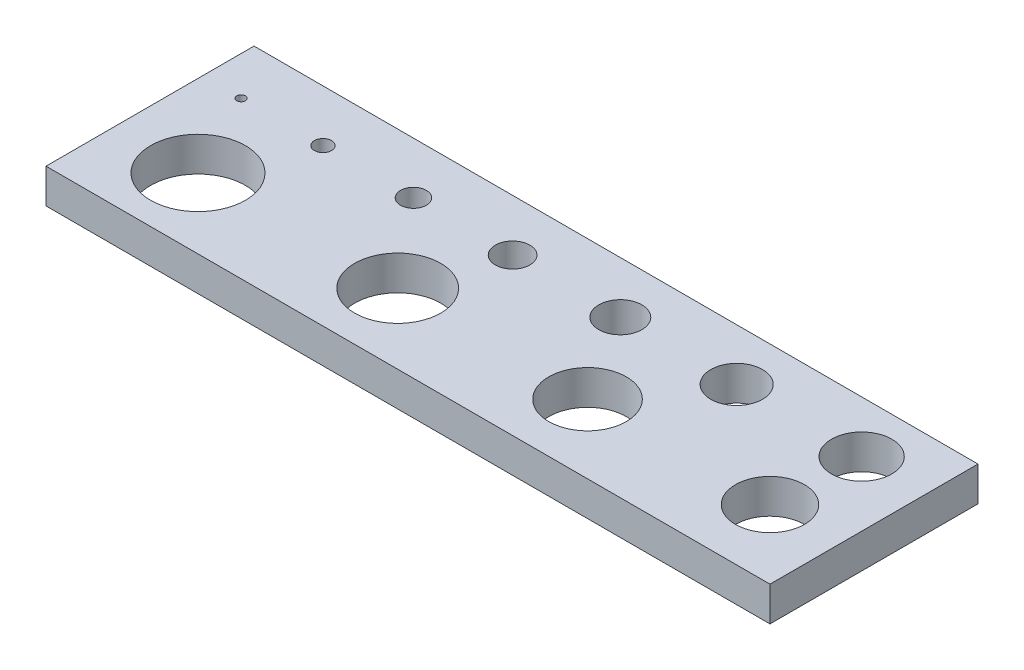
ISO-10303-21;
HEADER;
FILE_DESCRIPTION(('STEP AP214'),'2;1');
FILE_NAME('part.step','',(''),(''),'','','');
FILE_SCHEMA(('AUTOMOTIVE_DESIGN { 1 0 10303 214 1 1 1 1 }'));
ENDSEC;
DATA;
#1=APPLICATION_CONTEXT('core data for automotive mechanical design processes');
#2=APPLICATION_PROTOCOL_DEFINITION('international standard','automotive_design',2000,#1);
#3=PRODUCT_CONTEXT('',#1,'mechanical');
#4=PRODUCT('Part','Part','',(#3));
#5=PRODUCT_RELATED_PRODUCT_CATEGORY('part','',(#4));
#6=PRODUCT_DEFINITION_FORMATION('','',#4);
#7=PRODUCT_DEFINITION_CONTEXT('part definition',#1,'design');
#8=PRODUCT_DEFINITION('design','',#6,#7);
#9=PRODUCT_DEFINITION_SHAPE('','',#8);
#10=(LENGTH_UNIT() NAMED_UNIT(*) SI_UNIT(.MILLI.,.METRE.));
#11=(NAMED_UNIT(*) PLANE_ANGLE_UNIT() SI_UNIT($,.RADIAN.));
#12=(NAMED_UNIT(*) SI_UNIT($,.STERADIAN.) SOLID_ANGLE_UNIT());
#13=UNCERTAINTY_MEASURE_WITH_UNIT(LENGTH_MEASURE(1.E-05),#10,'distance_accuracy_value','');
#14=(GEOMETRIC_REPRESENTATION_CONTEXT(3) GLOBAL_UNCERTAINTY_ASSIGNED_CONTEXT((#13)) GLOBAL_UNIT_ASSIGNED_CONTEXT((#10,
#11,#12)) REPRESENTATION_CONTEXT('',''));
#15=CARTESIAN_POINT('',(0.,0.,0.));
#16=DIRECTION('',(0.,0.,1.));
#17=DIRECTION('',(1.,0.,0.));
#18=AXIS2_PLACEMENT_3D('',#15,#16,#17);
#19=CARTESIAN_POINT('',(0.,10.,0.));
#20=DIRECTION('',(0.,-1.,0.));
#21=DIRECTION('',(0.,0.,-1.));
#22=AXIS2_PLACEMENT_3D('',#19,#20,#21);
#23=PLANE('',#22);
#24=DIRECTION('',(0.,0.,1.));
#25=VECTOR('',#24,1.);
#26=CARTESIAN_POINT('',(-11.25,10.,45.3421622003745));
#27=LINE('',#26,#25);
#28=CARTESIAN_POINT('',(-11.25,10.,-15.));
#29=VERTEX_POINT('',#28);
#30=CARTESIAN_POINT('',(-11.25,10.,45.3421622003745));
#31=VERTEX_POINT('',#30);
#32=EDGE_CURVE('E85',#29,#31,#27,.T.);
#33=ORIENTED_EDGE('',*,*,#32,.T.);
#34=DIRECTION('',(1.,0.,0.));
#35=VECTOR('',#34,1.);
#36=CARTESIAN_POINT('',(-11.25,10.,45.3421622003745));
#37=LINE('',#36,#35);
#38=CARTESIAN_POINT('',(198.75,10.,45.3421622003745));
#39=VERTEX_POINT('',#38);
#40=EDGE_CURVE('E80',#31,#39,#37,.T.);
#41=ORIENTED_EDGE('',*,*,#40,.T.);
#42=DIRECTION('',(0.,0.,-1.));
#43=VECTOR('',#42,1.);
#44=CARTESIAN_POINT('',(198.75,10.,45.3421622003745));
#45=LINE('',#44,#43);
#46=CARTESIAN_POINT('',(198.75,10.,-15.));
#47=VERTEX_POINT('',#46);
#48=EDGE_CURVE('E83',#39,#47,#45,.T.);
#49=ORIENTED_EDGE('',*,*,#48,.T.);
#50=DIRECTION('',(-1.,0.,0.));
#51=VECTOR('',#50,1.);
#52=CARTESIAN_POINT('',(-11.25,10.,-15.));
#53=LINE('',#52,#51);
#54=EDGE_CURVE('E50',#47,#29,#53,.T.);
#55=ORIENTED_EDGE('',*,*,#54,.T.);
#56=EDGE_LOOP('',(#33,#41,#49,#55));
#57=FACE_BOUND('',#56,.T.);
#58=CARTESIAN_POINT('',(0.,10.,0.));
#59=DIRECTION('',(0.,1.,0.));
#60=DIRECTION('',(0.,0.,1.));
#61=AXIS2_PLACEMENT_3D('',#58,#59,#60);
#62=CIRCLE('',#61,1.25);
#63=CARTESIAN_POINT('',(0.,10.,1.25));
#64=VERTEX_POINT('',#63);
#65=EDGE_CURVE('E100',#64,#64,#62,.T.);
#66=ORIENTED_EDGE('',*,*,#65,.F.);
#67=EDGE_LOOP('',(#66));
#68=FACE_BOUND('',#67,.T.);
#69=CARTESIAN_POINT('',(23.75,10.,0.));
#70=DIRECTION('',(0.,1.,0.));
#71=DIRECTION('',(0.,0.,1.));
#72=AXIS2_PLACEMENT_3D('',#69,#70,#71);
#73=CIRCLE('',#72,2.49999999999999);
#74=CARTESIAN_POINT('',(23.75,10.,2.49999999999999));
#75=VERTEX_POINT('',#74);
#76=EDGE_CURVE('E115',#75,#75,#73,.T.);
#77=ORIENTED_EDGE('',*,*,#76,.F.);
#78=EDGE_LOOP('',(#77));
#79=FACE_BOUND('',#78,.T.);
#80=CARTESIAN_POINT('',(50.,10.,0.));
#81=DIRECTION('',(0.,1.,0.));
#82=DIRECTION('',(0.,0.,1.));
#83=AXIS2_PLACEMENT_3D('',#80,#81,#82);
#84=CIRCLE('',#83,3.75000000000001);
#85=CARTESIAN_POINT('',(50.,10.,3.75000000000001));
#86=VERTEX_POINT('',#85);
#87=EDGE_CURVE('E121',#86,#86,#84,.T.);
#88=ORIENTED_EDGE('',*,*,#87,.F.);
#89=EDGE_LOOP('',(#88));
#90=FACE_BOUND('',#89,.T.);
#91=CARTESIAN_POINT('',(78.75,10.,0.));
#92=DIRECTION('',(0.,1.,0.));
#93=DIRECTION('',(0.,0.,1.));
#94=AXIS2_PLACEMENT_3D('',#91,#92,#93);
#95=CIRCLE('',#94,4.99999999999999);
#96=CARTESIAN_POINT('',(78.75,10.,4.99999999999999));
#97=VERTEX_POINT('',#96);
#98=EDGE_CURVE('E127',#97,#97,#95,.T.);
#99=ORIENTED_EDGE('',*,*,#98,.F.);
#100=EDGE_LOOP('',(#99));
#101=FACE_BOUND('',#100,.T.);
#102=CARTESIAN_POINT('',(110.,10.,0.));
#103=DIRECTION('',(0.,1.,0.));
#104=DIRECTION('',(0.,0.,1.));
#105=AXIS2_PLACEMENT_3D('',#102,#103,#104);
#106=CIRCLE('',#105,6.25);
#107=CARTESIAN_POINT('',(110.,10.,6.25));
#108=VERTEX_POINT('',#107);
#109=EDGE_CURVE('E133',#108,#108,#106,.T.);
#110=ORIENTED_EDGE('',*,*,#109,.F.);
#111=EDGE_LOOP('',(#110));
#112=FACE_BOUND('',#111,.T.);
#113=CARTESIAN_POINT('',(143.75,10.,0.));
#114=DIRECTION('',(0.,1.,0.));
#115=DIRECTION('',(0.,0.,1.));
#116=AXIS2_PLACEMENT_3D('',#113,#114,#115);
#117=CIRCLE('',#116,7.50000000000001);
#118=CARTESIAN_POINT('',(143.75,10.,7.50000000000001));
#119=VERTEX_POINT('',#118);
#120=EDGE_CURVE('E139',#119,#119,#117,.T.);
#121=ORIENTED_EDGE('',*,*,#120,.F.);
#122=EDGE_LOOP('',(#121));
#123=FACE_BOUND('',#122,.T.);
#124=CARTESIAN_POINT('',(180.,10.,0.));
#125=DIRECTION('',(0.,1.,0.));
#126=DIRECTION('',(0.,0.,1.));
#127=AXIS2_PLACEMENT_3D('',#124,#125,#126);
#128=CIRCLE('',#127,8.74999999999997);
#129=CARTESIAN_POINT('',(180.,10.,8.74999999999997));
#130=VERTEX_POINT('',#129);
#131=EDGE_CURVE('E145',#130,#130,#128,.T.);
#132=ORIENTED_EDGE('',*,*,#131,.F.);
#133=EDGE_LOOP('',(#132));
#134=FACE_BOUND('',#133,.T.);
#135=CARTESIAN_POINT('',(178.75,10.,25.3421622003744));
#136=DIRECTION('',(0.,1.,0.));
#137=DIRECTION('',(0.,0.,1.));
#138=AXIS2_PLACEMENT_3D('',#135,#136,#137);
#139=CIRCLE('',#138,10.);
#140=CARTESIAN_POINT('',(178.75,10.,35.3421622003745));
#141=VERTEX_POINT('',#140);
#142=EDGE_CURVE('E151',#141,#141,#139,.T.);
#143=ORIENTED_EDGE('',*,*,#142,.F.);
#144=EDGE_LOOP('',(#143));
#145=FACE_BOUND('',#144,.T.);
#146=CARTESIAN_POINT('',(125.831772041199,10.,25.3421622003744));
#147=DIRECTION('',(0.,1.,0.));
#148=DIRECTION('',(0.,0.,1.));
#149=AXIS2_PLACEMENT_3D('',#146,#147,#148);
#150=CIRCLE('',#149,11.25);
#151=CARTESIAN_POINT('',(125.831772041199,10.,36.5921622003745));
#152=VERTEX_POINT('',#151);
#153=EDGE_CURVE('E157',#152,#152,#150,.T.);
#154=ORIENTED_EDGE('',*,*,#153,.F.);
#155=EDGE_LOOP('',(#154));
#156=FACE_BOUND('',#155,.T.);
#157=CARTESIAN_POINT('',(70.4182279588008,10.,25.));
#158=DIRECTION('',(0.,1.,0.));
#159=DIRECTION('',(0.,0.,1.));
#160=AXIS2_PLACEMENT_3D('',#157,#158,#159);
#161=CIRCLE('',#160,12.5);
#162=CARTESIAN_POINT('',(70.4182279588008,10.,37.5));
#163=VERTEX_POINT('',#162);
#164=EDGE_CURVE('E163',#163,#163,#161,.T.);
#165=ORIENTED_EDGE('',*,*,#164,.F.);
#166=EDGE_LOOP('',(#165));
#167=FACE_BOUND('',#166,.T.);
#168=CARTESIAN_POINT('',(12.5,10.,25.));
#169=DIRECTION('',(0.,1.,0.));
#170=DIRECTION('',(0.,0.,1.));
#171=AXIS2_PLACEMENT_3D('',#168,#169,#170);
#172=CIRCLE('',#171,13.75);
#173=CARTESIAN_POINT('',(12.5,10.,38.75));
#174=VERTEX_POINT('',#173);
#175=EDGE_CURVE('E169',#174,#174,#172,.T.);
#176=ORIENTED_EDGE('',*,*,#175,.F.);
#177=EDGE_LOOP('',(#176));
#178=FACE_BOUND('',#177,.T.);
#179=ADVANCED_FACE('F33',(#57,#68,#79,#90,#101,#112,#123,#134,#145,#156,#167,#178),#23,.F.);
#180=CARTESIAN_POINT('',(0.,0.,0.));
#181=DIRECTION('',(0.,-1.,0.));
#182=DIRECTION('',(0.,0.,-1.));
#183=AXIS2_PLACEMENT_3D('',#180,#181,#182);
#184=PLANE('',#183);
#185=CARTESIAN_POINT('',(70.4182279588008,0.,25.));
#186=DIRECTION('',(0.,1.,0.));
#187=DIRECTION('',(0.,0.,1.));
#188=AXIS2_PLACEMENT_3D('',#185,#186,#187);
#189=CIRCLE('',#188,12.5);
#190=CARTESIAN_POINT('',(70.4182279588008,0.,37.5));
#191=VERTEX_POINT('',#190);
#192=EDGE_CURVE('E166',#191,#191,#189,.T.);
#193=ORIENTED_EDGE('',*,*,#192,.T.);
#194=EDGE_LOOP('',(#193));
#195=FACE_BOUND('',#194,.T.);
#196=CARTESIAN_POINT('',(178.75,0.,25.3421622003744));
#197=DIRECTION('',(0.,1.,0.));
#198=DIRECTION('',(0.,0.,1.));
#199=AXIS2_PLACEMENT_3D('',#196,#197,#198);
#200=CIRCLE('',#199,10.);
#201=CARTESIAN_POINT('',(178.75,0.,35.3421622003745));
#202=VERTEX_POINT('',#201);
#203=EDGE_CURVE('E154',#202,#202,#200,.T.);
#204=ORIENTED_EDGE('',*,*,#203,.T.);
#205=EDGE_LOOP('',(#204));
#206=FACE_BOUND('',#205,.T.);
#207=CARTESIAN_POINT('',(143.75,0.,0.));
#208=DIRECTION('',(0.,1.,0.));
#209=DIRECTION('',(0.,0.,1.));
#210=AXIS2_PLACEMENT_3D('',#207,#208,#209);
#211=CIRCLE('',#210,7.50000000000001);
#212=CARTESIAN_POINT('',(143.75,0.,7.50000000000001));
#213=VERTEX_POINT('',#212);
#214=EDGE_CURVE('E142',#213,#213,#211,.T.);
#215=ORIENTED_EDGE('',*,*,#214,.T.);
#216=EDGE_LOOP('',(#215));
#217=FACE_BOUND('',#216,.T.);
#218=CARTESIAN_POINT('',(78.75,0.,0.));
#219=DIRECTION('',(0.,1.,0.));
#220=DIRECTION('',(0.,0.,1.));
#221=AXIS2_PLACEMENT_3D('',#218,#219,#220);
#222=CIRCLE('',#221,4.99999999999999);
#223=CARTESIAN_POINT('',(78.75,0.,4.99999999999999));
#224=VERTEX_POINT('',#223);
#225=EDGE_CURVE('E130',#224,#224,#222,.T.);
#226=ORIENTED_EDGE('',*,*,#225,.T.);
#227=EDGE_LOOP('',(#226));
#228=FACE_BOUND('',#227,.T.);
#229=CARTESIAN_POINT('',(23.75,0.,0.));
#230=DIRECTION('',(0.,1.,0.));
#231=DIRECTION('',(0.,0.,1.));
#232=AXIS2_PLACEMENT_3D('',#229,#230,#231);
#233=CIRCLE('',#232,2.49999999999999);
#234=CARTESIAN_POINT('',(23.75,0.,2.49999999999999));
#235=VERTEX_POINT('',#234);
#236=EDGE_CURVE('E118',#235,#235,#233,.T.);
#237=ORIENTED_EDGE('',*,*,#236,.T.);
#238=EDGE_LOOP('',(#237));
#239=FACE_BOUND('',#238,.T.);
#240=DIRECTION('',(0.,0.,1.));
#241=VECTOR('',#240,1.);
#242=CARTESIAN_POINT('',(-11.25,0.,45.3421622003745));
#243=LINE('',#242,#241);
#244=CARTESIAN_POINT('',(-11.25,0.,-15.));
#245=VERTEX_POINT('',#244);
#246=CARTESIAN_POINT('',(-11.25,0.,45.3421622003745));
#247=VERTEX_POINT('',#246);
#248=EDGE_CURVE('E97',#245,#247,#243,.T.);
#249=ORIENTED_EDGE('',*,*,#248,.F.);
#250=DIRECTION('',(-1.,0.,0.));
#251=VECTOR('',#250,1.);
#252=CARTESIAN_POINT('',(-11.25,0.,-15.));
#253=LINE('',#252,#251);
#254=CARTESIAN_POINT('',(198.75,0.,-15.));
#255=VERTEX_POINT('',#254);
#256=EDGE_CURVE('E73',#255,#245,#253,.T.);
#257=ORIENTED_EDGE('',*,*,#256,.F.);
#258=DIRECTION('',(0.,0.,-1.));
#259=VECTOR('',#258,1.);
#260=CARTESIAN_POINT('',(198.75,0.,45.3421622003745));
#261=LINE('',#260,#259);
#262=CARTESIAN_POINT('',(198.75,0.,45.3421622003745));
#263=VERTEX_POINT('',#262);
#264=EDGE_CURVE('E67',#263,#255,#261,.T.);
#265=ORIENTED_EDGE('',*,*,#264,.F.);
#266=DIRECTION('',(1.,0.,0.));
#267=VECTOR('',#266,1.);
#268=CARTESIAN_POINT('',(-11.25,0.,45.3421622003745));
#269=LINE('',#268,#267);
#270=EDGE_CURVE('E89',#247,#263,#269,.T.);
#271=ORIENTED_EDGE('',*,*,#270,.F.);
#272=EDGE_LOOP('',(#249,#257,#265,#271));
#273=FACE_BOUND('',#272,.T.);
#274=CARTESIAN_POINT('',(0.,0.,0.));
#275=DIRECTION('',(0.,1.,0.));
#276=DIRECTION('',(0.,0.,1.));
#277=AXIS2_PLACEMENT_3D('',#274,#275,#276);
#278=CIRCLE('',#277,1.25);
#279=CARTESIAN_POINT('',(0.,0.,1.25));
#280=VERTEX_POINT('',#279);
#281=EDGE_CURVE('E112',#280,#280,#278,.T.);
#282=ORIENTED_EDGE('',*,*,#281,.T.);
#283=EDGE_LOOP('',(#282));
#284=FACE_BOUND('',#283,.T.);
#285=CARTESIAN_POINT('',(50.,0.,0.));
#286=DIRECTION('',(0.,1.,0.));
#287=DIRECTION('',(0.,0.,1.));
#288=AXIS2_PLACEMENT_3D('',#285,#286,#287);
#289=CIRCLE('',#288,3.75000000000001);
#290=CARTESIAN_POINT('',(50.,0.,3.75000000000001));
#291=VERTEX_POINT('',#290);
#292=EDGE_CURVE('E124',#291,#291,#289,.T.);
#293=ORIENTED_EDGE('',*,*,#292,.T.);
#294=EDGE_LOOP('',(#293));
#295=FACE_BOUND('',#294,.T.);
#296=CARTESIAN_POINT('',(110.,0.,0.));
#297=DIRECTION('',(0.,1.,0.));
#298=DIRECTION('',(0.,0.,1.));
#299=AXIS2_PLACEMENT_3D('',#296,#297,#298);
#300=CIRCLE('',#299,6.25);
#301=CARTESIAN_POINT('',(110.,0.,6.25));
#302=VERTEX_POINT('',#301);
#303=EDGE_CURVE('E136',#302,#302,#300,.T.);
#304=ORIENTED_EDGE('',*,*,#303,.T.);
#305=EDGE_LOOP('',(#304));
#306=FACE_BOUND('',#305,.T.);
#307=CARTESIAN_POINT('',(180.,0.,0.));
#308=DIRECTION('',(0.,1.,0.));
#309=DIRECTION('',(0.,0.,1.));
#310=AXIS2_PLACEMENT_3D('',#307,#308,#309);
#311=CIRCLE('',#310,8.74999999999997);
#312=CARTESIAN_POINT('',(180.,0.,8.74999999999997));
#313=VERTEX_POINT('',#312);
#314=EDGE_CURVE('E148',#313,#313,#311,.T.);
#315=ORIENTED_EDGE('',*,*,#314,.T.);
#316=EDGE_LOOP('',(#315));
#317=FACE_BOUND('',#316,.T.);
#318=CARTESIAN_POINT('',(125.831772041199,0.,25.3421622003744));
#319=DIRECTION('',(0.,1.,0.));
#320=DIRECTION('',(0.,0.,1.));
#321=AXIS2_PLACEMENT_3D('',#318,#319,#320);
#322=CIRCLE('',#321,11.25);
#323=CARTESIAN_POINT('',(125.831772041199,0.,36.5921622003745));
#324=VERTEX_POINT('',#323);
#325=EDGE_CURVE('E160',#324,#324,#322,.T.);
#326=ORIENTED_EDGE('',*,*,#325,.T.);
#327=EDGE_LOOP('',(#326));
#328=FACE_BOUND('',#327,.T.);
#329=CARTESIAN_POINT('',(12.5,0.,25.));
#330=DIRECTION('',(0.,1.,0.));
#331=DIRECTION('',(0.,0.,1.));
#332=AXIS2_PLACEMENT_3D('',#329,#330,#331);
#333=CIRCLE('',#332,13.75);
#334=CARTESIAN_POINT('',(12.5,0.,38.75));
#335=VERTEX_POINT('',#334);
#336=EDGE_CURVE('E172',#335,#335,#333,.T.);
#337=ORIENTED_EDGE('',*,*,#336,.T.);
#338=EDGE_LOOP('',(#337));
#339=FACE_BOUND('',#338,.T.);
#340=ADVANCED_FACE('F108',(#195,#206,#217,#228,#239,#273,#284,#295,#306,#317,#328,#339),#184,.T.);
#341=CARTESIAN_POINT('',(-11.25,10.,45.3421622003745));
#342=DIRECTION('',(1.,0.,0.));
#343=DIRECTION('',(0.,0.,-1.));
#344=AXIS2_PLACEMENT_3D('',#341,#342,#343);
#345=PLANE('',#344);
#346=ORIENTED_EDGE('',*,*,#248,.T.);
#347=DIRECTION('',(0.,-1.,0.));
#348=VECTOR('',#347,1.);
#349=CARTESIAN_POINT('',(-11.25,10.,45.3421622003745));
#350=LINE('',#349,#348);
#351=EDGE_CURVE('E11',#31,#247,#350,.T.);
#352=ORIENTED_EDGE('',*,*,#351,.F.);
#353=ORIENTED_EDGE('',*,*,#32,.F.);
#354=DIRECTION('',(0.,-1.,0.));
#355=VECTOR('',#354,1.);
#356=CARTESIAN_POINT('',(-11.25,10.,-15.));
#357=LINE('',#356,#355);
#358=EDGE_CURVE('E93',#29,#245,#357,.T.);
#359=ORIENTED_EDGE('',*,*,#358,.T.);
#360=EDGE_LOOP('',(#346,#352,#353,#359));
#361=FACE_BOUND('',#360,.T.);
#362=ADVANCED_FACE('F35',(#361),#345,.F.);
#363=CARTESIAN_POINT('',(-11.25,10.,45.3421622003745));
#364=DIRECTION('',(0.,0.,-1.));
#365=DIRECTION('',(-1.,0.,0.));
#366=AXIS2_PLACEMENT_3D('',#363,#364,#365);
#367=PLANE('',#366);
#368=ORIENTED_EDGE('',*,*,#270,.T.);
#369=DIRECTION('',(0.,-1.,0.));
#370=VECTOR('',#369,1.);
#371=CARTESIAN_POINT('',(198.75,10.,45.3421622003745));
#372=LINE('',#371,#370);
#373=EDGE_CURVE('E42',#39,#263,#372,.T.);
#374=ORIENTED_EDGE('',*,*,#373,.F.);
#375=ORIENTED_EDGE('',*,*,#40,.F.);
#376=ORIENTED_EDGE('',*,*,#351,.T.);
#377=EDGE_LOOP('',(#368,#374,#375,#376));
#378=FACE_BOUND('',#377,.T.);
#379=ADVANCED_FACE('F88',(#378),#367,.F.);
#380=CARTESIAN_POINT('',(198.75,10.,45.3421622003745));
#381=DIRECTION('',(-1.,0.,0.));
#382=DIRECTION('',(0.,0.,1.));
#383=AXIS2_PLACEMENT_3D('',#380,#381,#382);
#384=PLANE('',#383);
#385=ORIENTED_EDGE('',*,*,#264,.T.);
#386=DIRECTION('',(0.,-1.,0.));
#387=VECTOR('',#386,1.);
#388=CARTESIAN_POINT('',(198.75,10.,-15.));
#389=LINE('',#388,#387);
#390=EDGE_CURVE('E90',#47,#255,#389,.T.);
#391=ORIENTED_EDGE('',*,*,#390,.F.);
#392=ORIENTED_EDGE('',*,*,#48,.F.);
#393=ORIENTED_EDGE('',*,*,#373,.T.);
#394=EDGE_LOOP('',(#385,#391,#392,#393));
#395=FACE_BOUND('',#394,.T.);
#396=ADVANCED_FACE('F91',(#395),#384,.F.);
#397=CARTESIAN_POINT('',(-11.25,10.,-15.));
#398=DIRECTION('',(0.,0.,1.));
#399=DIRECTION('',(1.,0.,0.));
#400=AXIS2_PLACEMENT_3D('',#397,#398,#399);
#401=PLANE('',#400);
#402=ORIENTED_EDGE('',*,*,#256,.T.);
#403=ORIENTED_EDGE('',*,*,#358,.F.);
#404=ORIENTED_EDGE('',*,*,#54,.F.);
#405=ORIENTED_EDGE('',*,*,#390,.T.);
#406=EDGE_LOOP('',(#402,#403,#404,#405));
#407=FACE_BOUND('',#406,.T.);
#408=ADVANCED_FACE('F105',(#407),#401,.F.);
#409=CARTESIAN_POINT('',(0.,10.,0.));
#410=DIRECTION('',(0.,-1.,0.));
#411=DIRECTION('',(0.,0.,-1.));
#412=AXIS2_PLACEMENT_3D('',#409,#410,#411);
#413=CYLINDRICAL_SURFACE('',#412,1.25);
#414=ORIENTED_EDGE('',*,*,#65,.T.);
#415=EDGE_LOOP('',(#414));
#416=FACE_BOUND('',#415,.T.);
#417=ORIENTED_EDGE('',*,*,#281,.F.);
#418=EDGE_LOOP('',(#417));
#419=FACE_BOUND('',#418,.T.);
#420=ADVANCED_FACE('F189',(#416,#419),#413,.F.);
#421=CARTESIAN_POINT('',(23.75,10.,0.));
#422=DIRECTION('',(0.,-1.,0.));
#423=DIRECTION('',(0.,0.,-1.));
#424=AXIS2_PLACEMENT_3D('',#421,#422,#423);
#425=CYLINDRICAL_SURFACE('',#424,2.49999999999999);
#426=ORIENTED_EDGE('',*,*,#76,.T.);
#427=EDGE_LOOP('',(#426));
#428=FACE_BOUND('',#427,.T.);
#429=ORIENTED_EDGE('',*,*,#236,.F.);
#430=EDGE_LOOP('',(#429));
#431=FACE_BOUND('',#430,.T.);
#432=ADVANCED_FACE('F235',(#428,#431),#425,.F.);
#433=CARTESIAN_POINT('',(50.,10.,0.));
#434=DIRECTION('',(0.,-1.,0.));
#435=DIRECTION('',(0.,0.,-1.));
#436=AXIS2_PLACEMENT_3D('',#433,#434,#435);
#437=CYLINDRICAL_SURFACE('',#436,3.75000000000001);
#438=ORIENTED_EDGE('',*,*,#87,.T.);
#439=EDGE_LOOP('',(#438));
#440=FACE_BOUND('',#439,.T.);
#441=ORIENTED_EDGE('',*,*,#292,.F.);
#442=EDGE_LOOP('',(#441));
#443=FACE_BOUND('',#442,.T.);
#444=ADVANCED_FACE('F243',(#440,#443),#437,.F.);
#445=CARTESIAN_POINT('',(78.75,10.,0.));
#446=DIRECTION('',(0.,-1.,0.));
#447=DIRECTION('',(0.,0.,-1.));
#448=AXIS2_PLACEMENT_3D('',#445,#446,#447);
#449=CYLINDRICAL_SURFACE('',#448,4.99999999999999);
#450=ORIENTED_EDGE('',*,*,#98,.T.);
#451=EDGE_LOOP('',(#450));
#452=FACE_BOUND('',#451,.T.);
#453=ORIENTED_EDGE('',*,*,#225,.F.);
#454=EDGE_LOOP('',(#453));
#455=FACE_BOUND('',#454,.T.);
#456=ADVANCED_FACE('F251',(#452,#455),#449,.F.);
#457=CARTESIAN_POINT('',(110.,10.,0.));
#458=DIRECTION('',(0.,-1.,0.));
#459=DIRECTION('',(0.,0.,-1.));
#460=AXIS2_PLACEMENT_3D('',#457,#458,#459);
#461=CYLINDRICAL_SURFACE('',#460,6.25);
#462=ORIENTED_EDGE('',*,*,#109,.T.);
#463=EDGE_LOOP('',(#462));
#464=FACE_BOUND('',#463,.T.);
#465=ORIENTED_EDGE('',*,*,#303,.F.);
#466=EDGE_LOOP('',(#465));
#467=FACE_BOUND('',#466,.T.);
#468=ADVANCED_FACE('F260',(#464,#467),#461,.F.);
#469=CARTESIAN_POINT('',(143.75,10.,0.));
#470=DIRECTION('',(0.,-1.,0.));
#471=DIRECTION('',(0.,0.,-1.));
#472=AXIS2_PLACEMENT_3D('',#469,#470,#471);
#473=CYLINDRICAL_SURFACE('',#472,7.50000000000001);
#474=ORIENTED_EDGE('',*,*,#120,.T.);
#475=EDGE_LOOP('',(#474));
#476=FACE_BOUND('',#475,.T.);
#477=ORIENTED_EDGE('',*,*,#214,.F.);
#478=EDGE_LOOP('',(#477));
#479=FACE_BOUND('',#478,.T.);
#480=ADVANCED_FACE('F269',(#476,#479),#473,.F.);
#481=CARTESIAN_POINT('',(180.,10.,0.));
#482=DIRECTION('',(0.,-1.,0.));
#483=DIRECTION('',(0.,0.,-1.));
#484=AXIS2_PLACEMENT_3D('',#481,#482,#483);
#485=CYLINDRICAL_SURFACE('',#484,8.74999999999997);
#486=ORIENTED_EDGE('',*,*,#131,.T.);
#487=EDGE_LOOP('',(#486));
#488=FACE_BOUND('',#487,.T.);
#489=ORIENTED_EDGE('',*,*,#314,.F.);
#490=EDGE_LOOP('',(#489));
#491=FACE_BOUND('',#490,.T.);
#492=ADVANCED_FACE('F278',(#488,#491),#485,.F.);
#493=CARTESIAN_POINT('',(178.75,10.,25.3421622003744));
#494=DIRECTION('',(0.,-1.,0.));
#495=DIRECTION('',(0.,0.,-1.));
#496=AXIS2_PLACEMENT_3D('',#493,#494,#495);
#497=CYLINDRICAL_SURFACE('',#496,10.);
#498=ORIENTED_EDGE('',*,*,#142,.T.);
#499=EDGE_LOOP('',(#498));
#500=FACE_BOUND('',#499,.T.);
#501=ORIENTED_EDGE('',*,*,#203,.F.);
#502=EDGE_LOOP('',(#501));
#503=FACE_BOUND('',#502,.T.);
#504=ADVANCED_FACE('F287',(#500,#503),#497,.F.);
#505=CARTESIAN_POINT('',(125.831772041199,10.,25.3421622003744));
#506=DIRECTION('',(0.,-1.,0.));
#507=DIRECTION('',(0.,0.,-1.));
#508=AXIS2_PLACEMENT_3D('',#505,#506,#507);
#509=CYLINDRICAL_SURFACE('',#508,11.25);
#510=ORIENTED_EDGE('',*,*,#153,.T.);
#511=EDGE_LOOP('',(#510));
#512=FACE_BOUND('',#511,.T.);
#513=ORIENTED_EDGE('',*,*,#325,.F.);
#514=EDGE_LOOP('',(#513));
#515=FACE_BOUND('',#514,.T.);
#516=ADVANCED_FACE('F296',(#512,#515),#509,.F.);
#517=CARTESIAN_POINT('',(70.4182279588008,10.,25.));
#518=DIRECTION('',(0.,-1.,0.));
#519=DIRECTION('',(0.,0.,-1.));
#520=AXIS2_PLACEMENT_3D('',#517,#518,#519);
#521=CYLINDRICAL_SURFACE('',#520,12.5);
#522=ORIENTED_EDGE('',*,*,#164,.T.);
#523=EDGE_LOOP('',(#522));
#524=FACE_BOUND('',#523,.T.);
#525=ORIENTED_EDGE('',*,*,#192,.F.);
#526=EDGE_LOOP('',(#525));
#527=FACE_BOUND('',#526,.T.);
#528=ADVANCED_FACE('F305',(#524,#527),#521,.F.);
#529=CARTESIAN_POINT('',(12.5,10.,25.));
#530=DIRECTION('',(0.,-1.,0.));
#531=DIRECTION('',(0.,0.,-1.));
#532=AXIS2_PLACEMENT_3D('',#529,#530,#531);
#533=CYLINDRICAL_SURFACE('',#532,13.75);
#534=ORIENTED_EDGE('',*,*,#175,.T.);
#535=EDGE_LOOP('',(#534));
#536=FACE_BOUND('',#535,.T.);
#537=ORIENTED_EDGE('',*,*,#336,.F.);
#538=EDGE_LOOP('',(#537));
#539=FACE_BOUND('',#538,.T.);
#540=ADVANCED_FACE('F178',(#536,#539),#533,.F.);
#541=CLOSED_SHELL('',(#179,#340,#362,#379,#396,#408,#420,#432,#444,#456,#468,#480,#492,#504,
#516,#528,#540));
#542=MANIFOLD_SOLID_BREP('B2',#541);
#543=ADVANCED_BREP_SHAPE_REPRESENTATION('',(#18,#542),#14);
#544=SHAPE_DEFINITION_REPRESENTATION(#9,#543);
ENDSEC;
END-ISO-10303-21;
